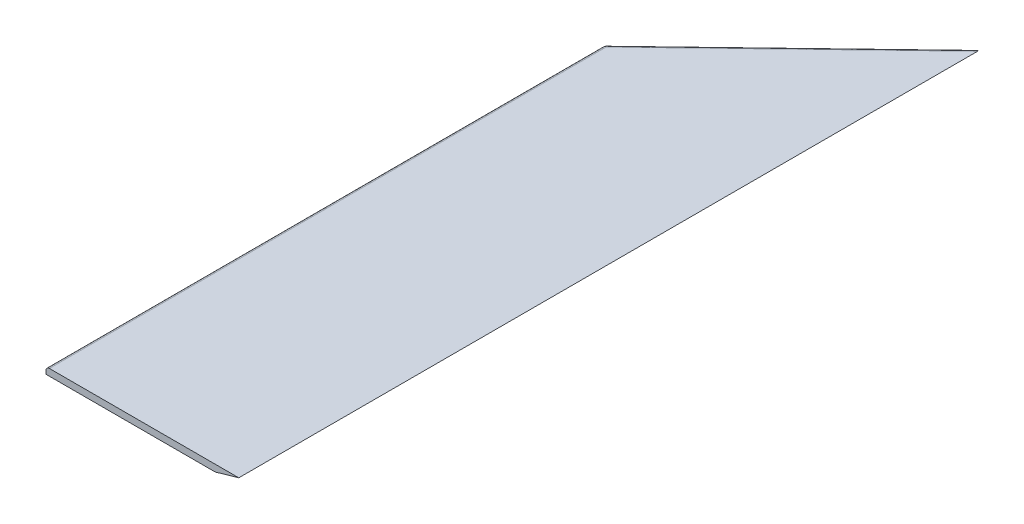
ISO-10303-21;
HEADER;
FILE_DESCRIPTION(('STEP AP214'),'2;1');
FILE_NAME('part.step','',(''),(''),'','','');
FILE_SCHEMA(('AUTOMOTIVE_DESIGN { 1 0 10303 214 1 1 1 1 }'));
ENDSEC;
DATA;
#1=APPLICATION_CONTEXT('core data for automotive mechanical design processes');
#2=APPLICATION_PROTOCOL_DEFINITION('international standard','automotive_design',2000,#1);
#3=PRODUCT_CONTEXT('',#1,'mechanical');
#4=PRODUCT('Part','Part','',(#3));
#5=PRODUCT_RELATED_PRODUCT_CATEGORY('part','',(#4));
#6=PRODUCT_DEFINITION_FORMATION('','',#4);
#7=PRODUCT_DEFINITION_CONTEXT('part definition',#1,'design');
#8=PRODUCT_DEFINITION('design','',#6,#7);
#9=PRODUCT_DEFINITION_SHAPE('','',#8);
#10=(LENGTH_UNIT() NAMED_UNIT(*) SI_UNIT(.MILLI.,.METRE.));
#11=(NAMED_UNIT(*) PLANE_ANGLE_UNIT() SI_UNIT($,.RADIAN.));
#12=(NAMED_UNIT(*) SI_UNIT($,.STERADIAN.) SOLID_ANGLE_UNIT());
#13=UNCERTAINTY_MEASURE_WITH_UNIT(LENGTH_MEASURE(1.E-05),#10,'distance_accuracy_value','');
#14=(GEOMETRIC_REPRESENTATION_CONTEXT(3) GLOBAL_UNCERTAINTY_ASSIGNED_CONTEXT((#13)) GLOBAL_UNIT_ASSIGNED_CONTEXT((#10,
#11,#12)) REPRESENTATION_CONTEXT('',''));
#15=CARTESIAN_POINT('',(0.,0.,0.));
#16=DIRECTION('',(0.,0.,1.));
#17=DIRECTION('',(1.,0.,0.));
#18=AXIS2_PLACEMENT_3D('',#15,#16,#17);
#19=CARTESIAN_POINT('',(3.175,-8.27786,-522.522974032734));
#20=DIRECTION('',(0.,-1.,0.));
#21=DIRECTION('',(0.,0.,-1.));
#22=AXIS2_PLACEMENT_3D('',#19,#20,#21);
#23=CYLINDRICAL_SURFACE('',#22,3.175);
#24=DIRECTION('',(0.,1.,0.));
#25=VECTOR('',#24,1.);
#26=CARTESIAN_POINT('',(0.974727259057256,6.35,-524.811953033358));
#27=LINE('',#26,#25);
#28=CARTESIAN_POINT('',(0.974727259045727,0.,-524.811953033368));
#29=VERTEX_POINT('',#28);
#30=CARTESIAN_POINT('',(0.974727259079935,3.175,-524.811953033332));
#31=VERTEX_POINT('',#30);
#32=EDGE_CURVE('E83',#29,#31,#27,.T.);
#33=ORIENTED_EDGE('',*,*,#32,.F.);
#34=CARTESIAN_POINT('',(3.175,0.,-522.522974032734));
#35=DIRECTION('',(0.,-1.,0.));
#36=DIRECTION('',(0.,0.,-1.));
#37=AXIS2_PLACEMENT_3D('',#34,#35,#36);
#38=CIRCLE('',#37,3.175);
#39=CARTESIAN_POINT('',(0.,0.,-522.522974032734));
#40=VERTEX_POINT('',#39);
#41=EDGE_CURVE('E19',#29,#40,#38,.F.);
#42=ORIENTED_EDGE('',*,*,#41,.T.);
#43=DIRECTION('',(0.,1.,0.));
#44=VECTOR('',#43,1.);
#45=CARTESIAN_POINT('',(0.,6.35,-522.522974032734));
#46=LINE('',#45,#44);
#47=CARTESIAN_POINT('',(0.,3.175,-522.522974031591));
#48=VERTEX_POINT('',#47);
#49=EDGE_CURVE('E72',#40,#48,#46,.T.);
#50=ORIENTED_EDGE('',*,*,#49,.T.);
#51=CARTESIAN_POINT('',(3.175,3.175,-522.522974032734));
#52=DIRECTION('',(0.,-1.,0.));
#53=DIRECTION('',(0.,0.,-1.));
#54=AXIS2_PLACEMENT_3D('',#51,#52,#53);
#55=CIRCLE('',#54,3.175);
#56=EDGE_CURVE('E90',#31,#48,#55,.F.);
#57=ORIENTED_EDGE('',*,*,#56,.F.);
#58=EDGE_LOOP('',(#33,#42,#50,#57));
#59=FACE_BOUND('',#58,.T.);
#60=ADVANCED_FACE('F16',(#59),#23,.T.);
#61=CARTESIAN_POINT('',(180.975,6.35,-697.83656067156));
#62=DIRECTION('',(-0.692999288492446,0.,-0.720938267918248));
#63=DIRECTION('',(-0.720938267918248,0.,0.692999288492446));
#64=AXIS2_PLACEMENT_3D('',#61,#62,#63);
#65=PLANE('',#64);
#66=ORIENTED_EDGE('',*,*,#32,.T.);
#67=DIRECTION('',(-0.720938267918248,0.,0.692999288492446));
#68=VECTOR('',#67,1.);
#69=CARTESIAN_POINT('',(-0.329839353453724,3.175,-523.557943120774));
#70=LINE('',#69,#68);
#71=CARTESIAN_POINT('',(169.902459140799,3.17499999999399,-687.193121033598));
#72=VERTEX_POINT('',#71);
#73=EDGE_CURVE('E92',#72,#31,#70,.T.);
#74=ORIENTED_EDGE('',*,*,#73,.F.);
#75=DIRECTION('',(-0.706010230216866,-0.202445175813205,0.678649766535794));
#76=VECTOR('',#75,1.);
#77=CARTESIAN_POINT('',(169.902459140808,3.1749999999993,-687.193121033666));
#78=LINE('',#77,#76);
#79=CARTESIAN_POINT('',(158.829918281616,0.,-676.549681395772));
#80=VERTEX_POINT('',#79);
#81=EDGE_CURVE('E108',#72,#80,#78,.T.);
#82=ORIENTED_EDGE('',*,*,#81,.T.);
#83=DIRECTION('',(-0.72093826791842,0.,0.692999288492267));
#84=VECTOR('',#83,1.);
#85=CARTESIAN_POINT('',(158.829918281616,0.,-676.549681395772));
#86=LINE('',#85,#84);
#87=EDGE_CURVE('E81',#80,#29,#86,.T.);
#88=ORIENTED_EDGE('',*,*,#87,.T.);
#89=EDGE_LOOP('',(#66,#74,#82,#88));
#90=FACE_BOUND('',#89,.T.);
#91=ADVANCED_FACE('F132',(#90),#65,.T.);
#92=CARTESIAN_POINT('',(0.,0.,0.));
#93=DIRECTION('',(0.,1.,0.));
#94=DIRECTION('',(0.,0.,1.));
#95=AXIS2_PLACEMENT_3D('',#92,#93,#94);
#96=PLANE('',#95);
#97=DIRECTION('',(0.,0.,1.));
#98=VECTOR('',#97,1.);
#99=CARTESIAN_POINT('',(158.829918281616,0.,0.));
#100=LINE('',#99,#98);
#101=CARTESIAN_POINT('',(158.829918281616,0.,0.));
#102=VERTEX_POINT('',#101);
#103=EDGE_CURVE('E165',#80,#102,#100,.T.);
#104=ORIENTED_EDGE('',*,*,#103,.T.);
#105=DIRECTION('',(1.,0.,0.));
#106=VECTOR('',#105,1.);
#107=CARTESIAN_POINT('',(0.,0.,0.));
#108=LINE('',#107,#106);
#109=CARTESIAN_POINT('',(0.,0.,0.));
#110=VERTEX_POINT('',#109);
#111=EDGE_CURVE('E89',#110,#102,#108,.T.);
#112=ORIENTED_EDGE('',*,*,#111,.F.);
#113=DIRECTION('',(0.,0.,-1.));
#114=VECTOR('',#113,1.);
#115=CARTESIAN_POINT('',(0.,0.,0.));
#116=LINE('',#115,#114);
#117=EDGE_CURVE('E76',#110,#40,#116,.T.);
#118=ORIENTED_EDGE('',*,*,#117,.T.);
#119=ORIENTED_EDGE('',*,*,#41,.F.);
#120=ORIENTED_EDGE('',*,*,#87,.F.);
#121=EDGE_LOOP('',(#104,#112,#118,#119,#120));
#122=FACE_BOUND('',#121,.T.);
#123=ADVANCED_FACE('F87',(#122),#96,.F.);
#124=CARTESIAN_POINT('',(0.,6.35,0.));
#125=DIRECTION('',(1.,0.,0.));
#126=DIRECTION('',(0.,0.,-1.));
#127=AXIS2_PLACEMENT_3D('',#124,#125,#126);
#128=PLANE('',#127);
#129=DIRECTION('',(0.,1.,0.));
#130=VECTOR('',#129,1.);
#131=CARTESIAN_POINT('',(0.,0.,0.));
#132=LINE('',#131,#130);
#133=CARTESIAN_POINT('',(0.,3.175,0.));
#134=VERTEX_POINT('',#133);
#135=EDGE_CURVE('E172',#134,#110,#132,.F.);
#136=ORIENTED_EDGE('',*,*,#135,.F.);
#137=DIRECTION('',(0.,0.,-1.));
#138=VECTOR('',#137,1.);
#139=CARTESIAN_POINT('',(0.,3.175,-1989.38896));
#140=LINE('',#139,#138);
#141=EDGE_CURVE('E78',#48,#134,#140,.F.);
#142=ORIENTED_EDGE('',*,*,#141,.F.);
#143=ORIENTED_EDGE('',*,*,#49,.F.);
#144=ORIENTED_EDGE('',*,*,#117,.F.);
#145=EDGE_LOOP('',(#136,#142,#143,#144));
#146=FACE_BOUND('',#145,.T.);
#147=ADVANCED_FACE('F74',(#146),#128,.F.);
#148=CARTESIAN_POINT('',(3.175,3.175,-522.522974032734));
#149=DIRECTION('',(-0.707106783321598,0.707106779051498,1.60614752088899E-09));
#150=DIRECTION('',(-6.81167501274426E-10,-2.95260311945943E-09,1.));
#151=AXIS2_PLACEMENT_3D('',#148,#149,#150);
#152=SPHERICAL_SURFACE('',#151,3.175);
#153=CARTESIAN_POINT('',(3.175,3.175,-522.522974030448));
#154=DIRECTION('',(0.,0.,-1.));
#155=DIRECTION('',(-1.,0.,0.));
#156=AXIS2_PLACEMENT_3D('',#153,#154,#155);
#157=CIRCLE('',#156,3.175);
#158=CARTESIAN_POINT('',(0.929935962953898,5.42006402348847,-522.522974030448));
#159=VERTEX_POINT('',#158);
#160=EDGE_CURVE('E100',#159,#48,#157,.F.);
#161=ORIENTED_EDGE('',*,*,#160,.F.);
#162=CARTESIAN_POINT('',(3.175,3.175,-522.522974030448));
#163=DIRECTION('',(0.,0.,-1.));
#164=DIRECTION('',(-1.,0.,0.));
#165=AXIS2_PLACEMENT_3D('',#162,#163,#164);
#166=CIRCLE('',#165,3.175);
#167=CARTESIAN_POINT('',(3.17500000110126,6.35,-522.52297403162));
#168=VERTEX_POINT('',#167);
#169=EDGE_CURVE('E33',#168,#159,#166,.F.);
#170=ORIENTED_EDGE('',*,*,#169,.F.);
#171=CARTESIAN_POINT('',(3.17500000006881,3.175,-522.522974032668));
#172=DIRECTION('',(-0.720938267918248,0.,0.692999288492446));
#173=DIRECTION('',(0.692999288492446,0.,0.720938267918248));
#174=AXIS2_PLACEMENT_3D('',#171,#172,#173);
#175=CIRCLE('',#174,3.175);
#176=EDGE_CURVE('E109',#31,#168,#175,.F.);
#177=ORIENTED_EDGE('',*,*,#176,.F.);
#178=ORIENTED_EDGE('',*,*,#56,.T.);
#179=EDGE_LOOP('',(#161,#170,#177,#178));
#180=FACE_BOUND('',#179,.T.);
#181=ADVANCED_FACE('F122',(#180),#152,.T.);
#182=CARTESIAN_POINT('',(1.87043338750979,3.175,-521.268964120134));
#183=DIRECTION('',(-0.720938267918248,0.,0.692999288492446));
#184=DIRECTION('',(0.692999288492446,0.,0.720938267918248));
#185=AXIS2_PLACEMENT_3D('',#182,#183,#184);
#186=CYLINDRICAL_SURFACE('',#185,3.175);
#187=DIRECTION('',(0.720938267918233,0.,-0.692999288492462));
#188=VECTOR('',#187,1.);
#189=CARTESIAN_POINT('',(3.1749999975616,6.35,-522.522974030448));
#190=LINE('',#189,#188);
#191=CARTESIAN_POINT('',(180.975000000005,6.35,-693.432577499516));
#192=VERTEX_POINT('',#191);
#193=EDGE_CURVE('E102',#168,#192,#190,.T.);
#194=ORIENTED_EDGE('',*,*,#193,.T.);
#195=CARTESIAN_POINT('',(169.902459140811,3.175,-682.789137861537));
#196=DIRECTION('',(-0.275637355817005,0.961261695938317,0.));
#197=DIRECTION('',(-0.679720084477433,-0.194906597831496,0.707101141902446));
#198=AXIS2_PLACEMENT_3D('',#195,#196,#197);
#199=ELLIPSE('',#198,15.9774539956602,3.175);
#200=EDGE_CURVE('E105',#192,#72,#199,.T.);
#201=ORIENTED_EDGE('',*,*,#200,.T.);
#202=ORIENTED_EDGE('',*,*,#73,.T.);
#203=ORIENTED_EDGE('',*,*,#176,.T.);
#204=EDGE_LOOP('',(#194,#201,#202,#203));
#205=FACE_BOUND('',#204,.T.);
#206=ADVANCED_FACE('F126',(#205),#186,.T.);
#207=CARTESIAN_POINT('',(158.829918281616,0.,0.));
#208=DIRECTION('',(-0.275637355817005,0.961261695938317,0.));
#209=DIRECTION('',(-0.961261695938317,-0.275637355817005,0.));
#210=AXIS2_PLACEMENT_3D('',#207,#208,#209);
#211=PLANE('',#210);
#212=DIRECTION('',(0.9612616959383,0.275637355817065,0.));
#213=VECTOR('',#212,1.);
#214=CARTESIAN_POINT('',(158.829918281616,0.,0.));
#215=LINE('',#214,#213);
#216=CARTESIAN_POINT('',(180.975,6.35,0.));
#217=VERTEX_POINT('',#216);
#218=EDGE_CURVE('E163',#102,#217,#215,.T.);
#219=ORIENTED_EDGE('',*,*,#218,.F.);
#220=ORIENTED_EDGE('',*,*,#103,.F.);
#221=ORIENTED_EDGE('',*,*,#81,.F.);
#222=ORIENTED_EDGE('',*,*,#200,.F.);
#223=DIRECTION('',(0.,0.,-1.));
#224=VECTOR('',#223,1.);
#225=CARTESIAN_POINT('',(180.975,6.35,0.));
#226=LINE('',#225,#224);
#227=EDGE_CURVE('E168',#192,#217,#226,.F.);
#228=ORIENTED_EDGE('',*,*,#227,.T.);
#229=EDGE_LOOP('',(#219,#220,#221,#222,#228));
#230=FACE_BOUND('',#229,.T.);
#231=ADVANCED_FACE('F152',(#230),#211,.F.);
#232=CARTESIAN_POINT('',(0.,0.,0.));
#233=DIRECTION('',(0.,0.,1.));
#234=DIRECTION('',(1.,0.,0.));
#235=AXIS2_PLACEMENT_3D('',#232,#233,#234);
#236=PLANE('',#235);
#237=DIRECTION('',(1.,0.,0.));
#238=VECTOR('',#237,1.);
#239=CARTESIAN_POINT('',(180.975,6.35,0.));
#240=LINE('',#239,#238);
#241=CARTESIAN_POINT('',(3.17500000000001,6.35,0.));
#242=VERTEX_POINT('',#241);
#243=EDGE_CURVE('E25',#217,#242,#240,.F.);
#244=ORIENTED_EDGE('',*,*,#243,.T.);
#245=CARTESIAN_POINT('',(3.175,3.175,0.));
#246=DIRECTION('',(0.,0.,-1.));
#247=DIRECTION('',(-1.,0.,0.));
#248=AXIS2_PLACEMENT_3D('',#245,#246,#247);
#249=CIRCLE('',#248,3.175);
#250=EDGE_CURVE('E103',#134,#242,#249,.T.);
#251=ORIENTED_EDGE('',*,*,#250,.F.);
#252=ORIENTED_EDGE('',*,*,#135,.T.);
#253=ORIENTED_EDGE('',*,*,#111,.T.);
#254=ORIENTED_EDGE('',*,*,#218,.T.);
#255=EDGE_LOOP('',(#244,#251,#252,#253,#254));
#256=FACE_BOUND('',#255,.T.);
#257=ADVANCED_FACE('F147',(#256),#236,.T.);
#258=CARTESIAN_POINT('',(3.175,3.175,-1989.38896));
#259=DIRECTION('',(0.,0.,-1.));
#260=DIRECTION('',(-1.,0.,0.));
#261=AXIS2_PLACEMENT_3D('',#258,#259,#260);
#262=CYLINDRICAL_SURFACE('',#261,3.175);
#263=DIRECTION('',(0.,0.,-1.));
#264=VECTOR('',#263,1.);
#265=CARTESIAN_POINT('',(3.17500000000001,6.35,0.));
#266=LINE('',#265,#264);
#267=EDGE_CURVE('E11',#242,#168,#266,.T.);
#268=ORIENTED_EDGE('',*,*,#267,.T.);
#269=ORIENTED_EDGE('',*,*,#169,.T.);
#270=ORIENTED_EDGE('',*,*,#160,.T.);
#271=ORIENTED_EDGE('',*,*,#141,.T.);
#272=ORIENTED_EDGE('',*,*,#250,.T.);
#273=EDGE_LOOP('',(#268,#269,#270,#271,#272));
#274=FACE_BOUND('',#273,.T.);
#275=ADVANCED_FACE('F141',(#274),#262,.T.);
#276=CARTESIAN_POINT('',(180.975,6.35,0.));
#277=DIRECTION('',(0.,-1.,0.));
#278=DIRECTION('',(0.,0.,-1.));
#279=AXIS2_PLACEMENT_3D('',#276,#277,#278);
#280=PLANE('',#279);
#281=ORIENTED_EDGE('',*,*,#243,.F.);
#282=ORIENTED_EDGE('',*,*,#227,.F.);
#283=ORIENTED_EDGE('',*,*,#193,.F.);
#284=ORIENTED_EDGE('',*,*,#267,.F.);
#285=EDGE_LOOP('',(#281,#282,#283,#284));
#286=FACE_BOUND('',#285,.T.);
#287=ADVANCED_FACE('F139',(#286),#280,.F.);
#288=CLOSED_SHELL('',(#60,#91,#123,#147,#181,#206,#231,#257,#275,#287));
#289=MANIFOLD_SOLID_BREP('B1',#288);
#290=ADVANCED_BREP_SHAPE_REPRESENTATION('',(#18,#289),#14);
#291=SHAPE_DEFINITION_REPRESENTATION(#9,#290);
ENDSEC;
END-ISO-10303-21;
